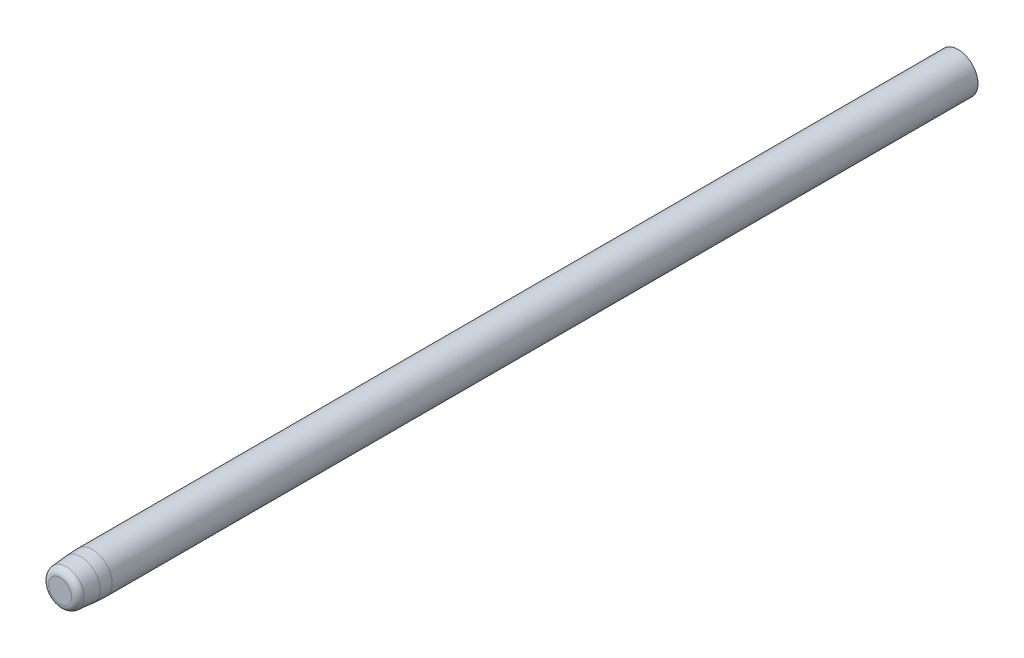
ISO-10303-21;
HEADER;
FILE_DESCRIPTION(('STEP AP214'),'2;1');
FILE_NAME('part.step','',(''),(''),'','','');
FILE_SCHEMA(('AUTOMOTIVE_DESIGN { 1 0 10303 214 1 1 1 1 }'));
ENDSEC;
DATA;
#1=APPLICATION_CONTEXT('core data for automotive mechanical design processes');
#2=APPLICATION_PROTOCOL_DEFINITION('international standard','automotive_design',2000,#1);
#3=PRODUCT_CONTEXT('',#1,'mechanical');
#4=PRODUCT('Part','Part','',(#3));
#5=PRODUCT_RELATED_PRODUCT_CATEGORY('part','',(#4));
#6=PRODUCT_DEFINITION_FORMATION('','',#4);
#7=PRODUCT_DEFINITION_CONTEXT('part definition',#1,'design');
#8=PRODUCT_DEFINITION('design','',#6,#7);
#9=PRODUCT_DEFINITION_SHAPE('','',#8);
#10=(LENGTH_UNIT() NAMED_UNIT(*) SI_UNIT(.MILLI.,.METRE.));
#11=(NAMED_UNIT(*) PLANE_ANGLE_UNIT() SI_UNIT($,.RADIAN.));
#12=(NAMED_UNIT(*) SI_UNIT($,.STERADIAN.) SOLID_ANGLE_UNIT());
#13=UNCERTAINTY_MEASURE_WITH_UNIT(LENGTH_MEASURE(1.E-05),#10,'distance_accuracy_value','');
#14=(GEOMETRIC_REPRESENTATION_CONTEXT(3) GLOBAL_UNCERTAINTY_ASSIGNED_CONTEXT((#13)) GLOBAL_UNIT_ASSIGNED_CONTEXT((#10,
#11,#12)) REPRESENTATION_CONTEXT('',''));
#15=CARTESIAN_POINT('',(0.,0.,0.));
#16=DIRECTION('',(0.,0.,1.));
#17=DIRECTION('',(1.,0.,0.));
#18=AXIS2_PLACEMENT_3D('',#15,#16,#17);
#19=CARTESIAN_POINT('',(0.,0.,86.36));
#20=DIRECTION('',(0.,0.,-1.));
#21=DIRECTION('',(-1.,0.,0.));
#22=AXIS2_PLACEMENT_3D('',#19,#20,#21);
#23=CYLINDRICAL_SURFACE('',#22,1.905);
#24=CARTESIAN_POINT('',(0.,0.,83.2655060250614));
#25=DIRECTION('',(0.,0.,1.));
#26=DIRECTION('',(1.,0.,0.));
#27=AXIS2_PLACEMENT_3D('',#24,#25,#26);
#28=CIRCLE('',#27,1.905);
#29=CARTESIAN_POINT('',(1.905,0.,83.2655060250614));
#30=VERTEX_POINT('',#29);
#31=EDGE_CURVE('E47',#30,#30,#28,.F.);
#32=ORIENTED_EDGE('',*,*,#31,.T.);
#33=EDGE_LOOP('',(#32));
#34=FACE_BOUND('',#33,.T.);
#35=CARTESIAN_POINT('',(0.,0.,0.));
#36=DIRECTION('',(0.,0.,1.));
#37=DIRECTION('',(1.,0.,0.));
#38=AXIS2_PLACEMENT_3D('',#35,#36,#37);
#39=CIRCLE('',#38,1.905);
#40=CARTESIAN_POINT('',(1.905,0.,0.));
#41=VERTEX_POINT('',#40);
#42=EDGE_CURVE('E52',#41,#41,#39,.T.);
#43=ORIENTED_EDGE('',*,*,#42,.T.);
#44=EDGE_LOOP('',(#43));
#45=FACE_BOUND('',#44,.T.);
#46=ADVANCED_FACE('F32',(#34,#45),#23,.T.);
#47=CARTESIAN_POINT('',(0.,0.,86.36));
#48=DIRECTION('',(0.,0.,1.));
#49=DIRECTION('',(1.,0.,0.));
#50=AXIS2_PLACEMENT_3D('',#47,#48,#49);
#51=PLANE('',#50);
#52=CARTESIAN_POINT('',(0.,0.,86.36));
#53=DIRECTION('',(0.,0.,1.));
#54=DIRECTION('',(1.,0.,0.));
#55=AXIS2_PLACEMENT_3D('',#52,#53,#54);
#56=CIRCLE('',#55,1.10090849914305);
#57=CARTESIAN_POINT('',(1.10090849914305,0.,86.36));
#58=VERTEX_POINT('',#57);
#59=EDGE_CURVE('E39',#58,#58,#56,.T.);
#60=ORIENTED_EDGE('',*,*,#59,.T.);
#61=EDGE_LOOP('',(#60));
#62=FACE_BOUND('',#61,.T.);
#63=ADVANCED_FACE('F60',(#62),#51,.T.);
#64=CARTESIAN_POINT('',(0.,0.,0.));
#65=DIRECTION('',(0.,0.,1.));
#66=DIRECTION('',(1.,0.,0.));
#67=AXIS2_PLACEMENT_3D('',#64,#65,#66);
#68=PLANE('',#67);
#69=ORIENTED_EDGE('',*,*,#42,.F.);
#70=EDGE_LOOP('',(#69));
#71=FACE_BOUND('',#70,.T.);
#72=ADVANCED_FACE('F57',(#71),#68,.F.);
#73=CARTESIAN_POINT('',(0.,0.,86.36));
#74=DIRECTION('',(0.,0.,-1.));
#75=DIRECTION('',(-1.,0.,0.));
#76=AXIS2_PLACEMENT_3D('',#73,#74,#75);
#77=CONICAL_SURFACE('',#76,1.68277879464411,0.0872664625997136);
#78=CARTESIAN_POINT('',(0.,0.,85.7803438966448));
#79=DIRECTION('',(0.,0.,1.));
#80=DIRECTION('',(1.,0.,0.));
#81=AXIS2_PLACEMENT_3D('',#78,#79,#80);
#82=CIRCLE('',#81,1.73349213243131);
#83=CARTESIAN_POINT('',(1.73349213243131,0.,85.7803438966448));
#84=VERTEX_POINT('',#83);
#85=EDGE_CURVE('E10',#84,#84,#82,.F.);
#86=ORIENTED_EDGE('',*,*,#85,.T.);
#87=EDGE_LOOP('',(#86));
#88=FACE_BOUND('',#87,.T.);
#89=CARTESIAN_POINT('',(0.,0.,84.3723839579566));
#90=DIRECTION('',(0.,0.,-1.));
#91=DIRECTION('',(-1.,0.,0.));
#92=AXIS2_PLACEMENT_3D('',#89,#90,#91);
#93=CIRCLE('',#92,1.85667266576517);
#94=CARTESIAN_POINT('',(-1.85667266576517,0.,84.3723839579566));
#95=VERTEX_POINT('',#94);
#96=EDGE_CURVE('E43',#95,#95,#93,.F.);
#97=ORIENTED_EDGE('',*,*,#96,.T.);
#98=EDGE_LOOP('',(#97));
#99=FACE_BOUND('',#98,.T.);
#100=ADVANCED_FACE('F59',(#88,#99),#77,.T.);
#101=CARTESIAN_POINT('',(0.,0.,83.2655060250614));
#102=DIRECTION('',(0.,0.,1.));
#103=DIRECTION('',(1.,0.,0.));
#104=AXIS2_PLACEMENT_3D('',#101,#102,#103);
#105=DEGENERATE_TOROIDAL_SURFACE('',#104,10.795,12.7,.F.);
#106=ORIENTED_EDGE('',*,*,#96,.F.);
#107=EDGE_LOOP('',(#106));
#108=FACE_BOUND('',#107,.T.);
#109=ORIENTED_EDGE('',*,*,#31,.F.);
#110=EDGE_LOOP('',(#109));
#111=FACE_BOUND('',#110,.T.);
#112=ADVANCED_FACE('F66',(#108,#111),#105,.F.);
#113=CARTESIAN_POINT('',(0.,0.,85.725));
#114=DIRECTION('',(0.,0.,1.));
#115=DIRECTION('',(1.,0.,0.));
#116=AXIS2_PLACEMENT_3D('',#113,#114,#115);
#117=TOROIDAL_SURFACE('',#116,1.10090849914305,0.635);
#118=ORIENTED_EDGE('',*,*,#85,.F.);
#119=EDGE_LOOP('',(#118));
#120=FACE_BOUND('',#119,.T.);
#121=ORIENTED_EDGE('',*,*,#59,.F.);
#122=EDGE_LOOP('',(#121));
#123=FACE_BOUND('',#122,.T.);
#124=ADVANCED_FACE('F34',(#120,#123),#117,.T.);
#125=CLOSED_SHELL('',(#46,#63,#72,#100,#112,#124));
#126=MANIFOLD_SOLID_BREP('B2',#125);
#127=ADVANCED_BREP_SHAPE_REPRESENTATION('',(#18,#126),#14);
#128=SHAPE_DEFINITION_REPRESENTATION(#9,#127);
ENDSEC;
END-ISO-10303-21;
